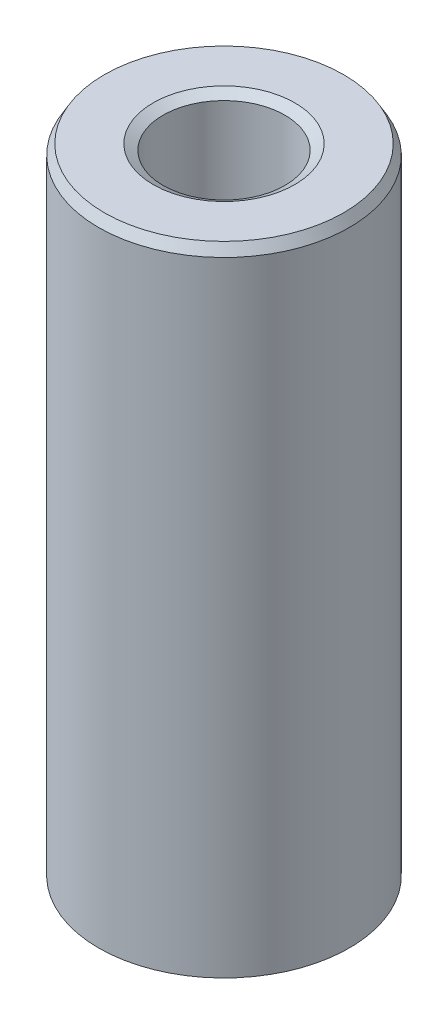
ISO-10303-21;
HEADER;
FILE_DESCRIPTION(('STEP AP214'),'2;1');
FILE_NAME('part.step','',(''),(''),'','','');
FILE_SCHEMA(('AUTOMOTIVE_DESIGN { 1 0 10303 214 1 1 1 1 }'));
ENDSEC;
DATA;
#1=APPLICATION_CONTEXT('core data for automotive mechanical design processes');
#2=APPLICATION_PROTOCOL_DEFINITION('international standard','automotive_design',2000,#1);
#3=PRODUCT_CONTEXT('',#1,'mechanical');
#4=PRODUCT('Part','Part','',(#3));
#5=PRODUCT_RELATED_PRODUCT_CATEGORY('part','',(#4));
#6=PRODUCT_DEFINITION_FORMATION('','',#4);
#7=PRODUCT_DEFINITION_CONTEXT('part definition',#1,'design');
#8=PRODUCT_DEFINITION('design','',#6,#7);
#9=PRODUCT_DEFINITION_SHAPE('','',#8);
#10=(LENGTH_UNIT() NAMED_UNIT(*) SI_UNIT(.MILLI.,.METRE.));
#11=(NAMED_UNIT(*) PLANE_ANGLE_UNIT() SI_UNIT($,.RADIAN.));
#12=(NAMED_UNIT(*) SI_UNIT($,.STERADIAN.) SOLID_ANGLE_UNIT());
#13=UNCERTAINTY_MEASURE_WITH_UNIT(LENGTH_MEASURE(1.E-05),#10,'distance_accuracy_value','');
#14=(GEOMETRIC_REPRESENTATION_CONTEXT(3) GLOBAL_UNCERTAINTY_ASSIGNED_CONTEXT((#13)) GLOBAL_UNIT_ASSIGNED_CONTEXT((#10,
#11,#12)) REPRESENTATION_CONTEXT('',''));
#15=CARTESIAN_POINT('',(0.,0.,0.));
#16=DIRECTION('',(0.,0.,1.));
#17=DIRECTION('',(1.,0.,0.));
#18=AXIS2_PLACEMENT_3D('',#15,#16,#17);
#19=CARTESIAN_POINT('',(0.,89.2717811232554,0.));
#20=DIRECTION('',(0.,-1.,0.));
#21=DIRECTION('',(0.,0.,-1.));
#22=AXIS2_PLACEMENT_3D('',#19,#20,#21);
#23=CYLINDRICAL_SURFACE('',#22,17.5);
#24=CARTESIAN_POINT('',(0.,0.798636249418838,0.));
#25=DIRECTION('',(0.,1.,0.));
#26=DIRECTION('',(0.,0.,1.));
#27=AXIS2_PLACEMENT_3D('',#24,#25,#26);
#28=CIRCLE('',#27,17.5);
#29=CARTESIAN_POINT('',(0.,0.798636249418838,17.5));
#30=VERTEX_POINT('',#29);
#31=EDGE_CURVE('E10',#30,#30,#28,.T.);
#32=ORIENTED_EDGE('',*,*,#31,.T.);
#33=EDGE_LOOP('',(#32));
#34=FACE_BOUND('',#33,.T.);
#35=CARTESIAN_POINT('',(0.,87.8885025624957,0.));
#36=DIRECTION('',(0.,1.,0.));
#37=DIRECTION('',(0.,0.,1.));
#38=AXIS2_PLACEMENT_3D('',#35,#36,#37);
#39=CIRCLE('',#38,17.5);
#40=CARTESIAN_POINT('',(0.,87.8885025624957,17.5));
#41=VERTEX_POINT('',#40);
#42=EDGE_CURVE('E50',#41,#41,#39,.F.);
#43=ORIENTED_EDGE('',*,*,#42,.T.);
#44=EDGE_LOOP('',(#43));
#45=FACE_BOUND('',#44,.T.);
#46=ADVANCED_FACE('F39',(#34,#45),#23,.T.);
#47=CARTESIAN_POINT('',(0.,89.2717811232554,0.));
#48=DIRECTION('',(0.,1.,0.));
#49=DIRECTION('',(0.,0.,1.));
#50=AXIS2_PLACEMENT_3D('',#47,#48,#49);
#51=PLANE('',#50);
#52=CARTESIAN_POINT('',(0.,89.2717811232554,0.));
#53=DIRECTION('',(0.,1.,0.));
#54=DIRECTION('',(0.,0.,1.));
#55=AXIS2_PLACEMENT_3D('',#52,#53,#54);
#56=CIRCLE('',#55,9.88979894331908);
#57=CARTESIAN_POINT('',(0.,89.2717811232554,9.88979894331908));
#58=VERTEX_POINT('',#57);
#59=EDGE_CURVE('E58',#58,#58,#56,.F.);
#60=ORIENTED_EDGE('',*,*,#59,.T.);
#61=EDGE_LOOP('',(#60));
#62=FACE_BOUND('',#61,.T.);
#63=CARTESIAN_POINT('',(0.,89.2717811232554,0.));
#64=DIRECTION('',(0.,1.,0.));
#65=DIRECTION('',(0.,0.,1.));
#66=AXIS2_PLACEMENT_3D('',#63,#64,#65);
#67=CIRCLE('',#66,16.7013637505812);
#68=CARTESIAN_POINT('',(0.,89.2717811232554,16.7013637505812));
#69=VERTEX_POINT('',#68);
#70=EDGE_CURVE('E61',#69,#69,#67,.T.);
#71=ORIENTED_EDGE('',*,*,#70,.T.);
#72=EDGE_LOOP('',(#71));
#73=FACE_BOUND('',#72,.T.);
#74=ADVANCED_FACE('F88',(#62,#73),#51,.T.);
#75=CARTESIAN_POINT('',(0.,0.,0.));
#76=DIRECTION('',(0.,1.,0.));
#77=DIRECTION('',(0.,0.,1.));
#78=AXIS2_PLACEMENT_3D('',#75,#76,#77);
#79=PLANE('',#78);
#80=CARTESIAN_POINT('',(0.,0.,0.));
#81=DIRECTION('',(0.,1.,0.));
#82=DIRECTION('',(0.,0.,1.));
#83=AXIS2_PLACEMENT_3D('',#80,#81,#82);
#84=CIRCLE('',#83,9.30515663197827);
#85=CARTESIAN_POINT('',(0.,0.,9.30515663197827));
#86=VERTEX_POINT('',#85);
#87=EDGE_CURVE('E51',#86,#86,#84,.T.);
#88=ORIENTED_EDGE('',*,*,#87,.T.);
#89=EDGE_LOOP('',(#88));
#90=FACE_BOUND('',#89,.T.);
#91=CARTESIAN_POINT('',(0.,0.,0.));
#92=DIRECTION('',(0.,1.,0.));
#93=DIRECTION('',(0.,0.,1.));
#94=AXIS2_PLACEMENT_3D('',#91,#92,#93);
#95=CIRCLE('',#94,16.1167214392403);
#96=CARTESIAN_POINT('',(0.,0.,16.1167214392403));
#97=VERTEX_POINT('',#96);
#98=EDGE_CURVE('E54',#97,#97,#95,.F.);
#99=ORIENTED_EDGE('',*,*,#98,.T.);
#100=EDGE_LOOP('',(#99));
#101=FACE_BOUND('',#100,.T.);
#102=ADVANCED_FACE('F83',(#90,#101),#79,.F.);
#103=CARTESIAN_POINT('',(0.,89.2717811232554,0.));
#104=DIRECTION('',(0.,-1.,0.));
#105=DIRECTION('',(0.,0.,-1.));
#106=AXIS2_PLACEMENT_3D('',#103,#104,#105);
#107=CYLINDRICAL_SURFACE('',#106,8.50652038255943);
#108=CARTESIAN_POINT('',(0.,88.4731448738365,0.));
#109=DIRECTION('',(0.,1.,0.));
#110=DIRECTION('',(0.,0.,1.));
#111=AXIS2_PLACEMENT_3D('',#108,#109,#110);
#112=CIRCLE('',#111,8.50652038255943);
#113=CARTESIAN_POINT('',(0.,88.4731448738365,8.50652038255943));
#114=VERTEX_POINT('',#113);
#115=EDGE_CURVE('E67',#114,#114,#112,.T.);
#116=ORIENTED_EDGE('',*,*,#115,.T.);
#117=EDGE_LOOP('',(#116));
#118=FACE_BOUND('',#117,.T.);
#119=CARTESIAN_POINT('',(0.,1.3832785607597,0.));
#120=DIRECTION('',(0.,1.,0.));
#121=DIRECTION('',(0.,0.,1.));
#122=AXIS2_PLACEMENT_3D('',#119,#120,#121);
#123=CIRCLE('',#122,8.50652038255943);
#124=CARTESIAN_POINT('',(0.,1.3832785607597,8.50652038255943));
#125=VERTEX_POINT('',#124);
#126=EDGE_CURVE('E69',#125,#125,#123,.F.);
#127=ORIENTED_EDGE('',*,*,#126,.T.);
#128=EDGE_LOOP('',(#127));
#129=FACE_BOUND('',#128,.T.);
#130=ADVANCED_FACE('F71',(#118,#129),#107,.F.);
#131=CARTESIAN_POINT('',(0.,88.4731448738365,0.));
#132=DIRECTION('',(0.,1.,0.));
#133=DIRECTION('',(0.,0.,1.));
#134=AXIS2_PLACEMENT_3D('',#131,#132,#133);
#135=CONICAL_SURFACE('',#134,8.50652038255943,1.0471975511966);
#136=ORIENTED_EDGE('',*,*,#59,.F.);
#137=EDGE_LOOP('',(#136));
#138=FACE_BOUND('',#137,.T.);
#139=ORIENTED_EDGE('',*,*,#115,.F.);
#140=EDGE_LOOP('',(#139));
#141=FACE_BOUND('',#140,.T.);
#142=ADVANCED_FACE('F77',(#138,#141),#135,.F.);
#143=CARTESIAN_POINT('',(0.,0.,0.));
#144=DIRECTION('',(0.,-1.,0.));
#145=DIRECTION('',(0.,0.,-1.));
#146=AXIS2_PLACEMENT_3D('',#143,#144,#145);
#147=CONICAL_SURFACE('',#146,9.30515663197827,0.523598775598294);
#148=ORIENTED_EDGE('',*,*,#126,.F.);
#149=EDGE_LOOP('',(#148));
#150=FACE_BOUND('',#149,.T.);
#151=ORIENTED_EDGE('',*,*,#87,.F.);
#152=EDGE_LOOP('',(#151));
#153=FACE_BOUND('',#152,.T.);
#154=ADVANCED_FACE('F73',(#150,#153),#147,.F.);
#155=CARTESIAN_POINT('',(0.,0.798636249418838,0.));
#156=DIRECTION('',(0.,1.,0.));
#157=DIRECTION('',(0.,0.,1.));
#158=AXIS2_PLACEMENT_3D('',#155,#156,#157);
#159=CONICAL_SURFACE('',#158,17.5,1.04719755119661);
#160=ORIENTED_EDGE('',*,*,#98,.F.);
#161=EDGE_LOOP('',(#160));
#162=FACE_BOUND('',#161,.T.);
#163=ORIENTED_EDGE('',*,*,#31,.F.);
#164=EDGE_LOOP('',(#163));
#165=FACE_BOUND('',#164,.T.);
#166=ADVANCED_FACE('F76',(#162,#165),#159,.T.);
#167=CARTESIAN_POINT('',(0.,89.2717811232554,0.));
#168=DIRECTION('',(0.,-1.,0.));
#169=DIRECTION('',(0.,0.,-1.));
#170=AXIS2_PLACEMENT_3D('',#167,#168,#169);
#171=CONICAL_SURFACE('',#170,16.7013637505812,0.523598775598294);
#172=ORIENTED_EDGE('',*,*,#42,.F.);
#173=EDGE_LOOP('',(#172));
#174=FACE_BOUND('',#173,.T.);
#175=ORIENTED_EDGE('',*,*,#70,.F.);
#176=EDGE_LOOP('',(#175));
#177=FACE_BOUND('',#176,.T.);
#178=ADVANCED_FACE('F45',(#174,#177),#171,.T.);
#179=CLOSED_SHELL('',(#46,#74,#102,#130,#142,#154,#166,#178));
#180=MANIFOLD_SOLID_BREP('B2',#179);
#181=ADVANCED_BREP_SHAPE_REPRESENTATION('',(#18,#180),#14);
#182=SHAPE_DEFINITION_REPRESENTATION(#9,#181);
ENDSEC;
END-ISO-10303-21;
